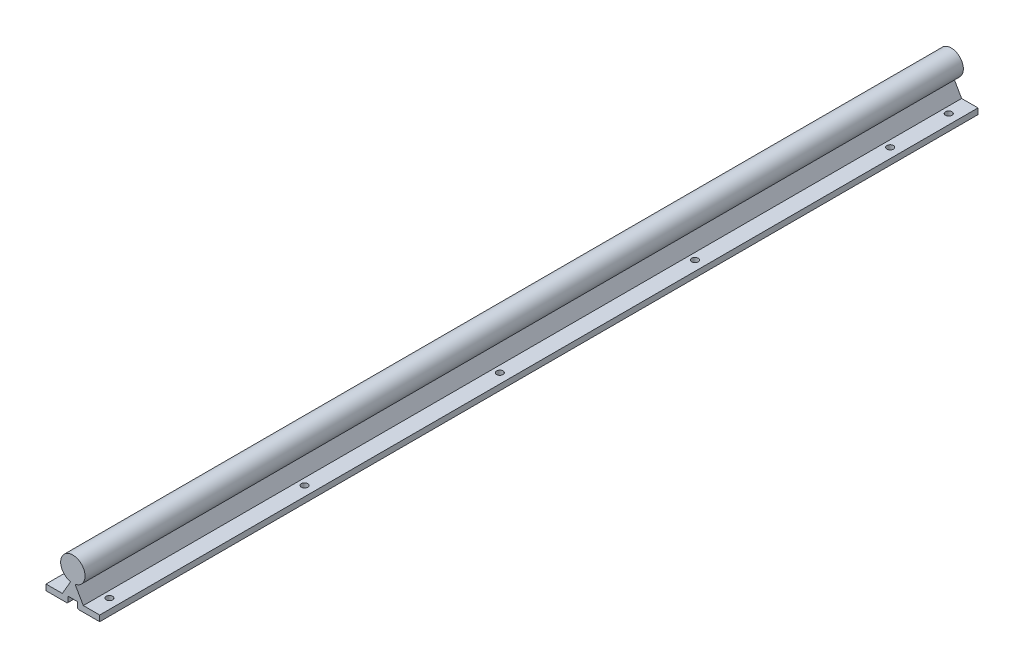
ISO-10303-21;
HEADER;
FILE_DESCRIPTION(('STEP AP214'),'2;1');
FILE_NAME('part.step','',(''),(''),'','','');
FILE_SCHEMA(('AUTOMOTIVE_DESIGN { 1 0 10303 214 1 1 1 1 }'));
ENDSEC;
DATA;
#1=APPLICATION_CONTEXT('core data for automotive mechanical design processes');
#2=APPLICATION_PROTOCOL_DEFINITION('international standard','automotive_design',2000,#1);
#3=PRODUCT_CONTEXT('',#1,'mechanical');
#4=PRODUCT('Part','Part','',(#3));
#5=PRODUCT_RELATED_PRODUCT_CATEGORY('part','',(#4));
#6=PRODUCT_DEFINITION_FORMATION('','',#4);
#7=PRODUCT_DEFINITION_CONTEXT('part definition',#1,'design');
#8=PRODUCT_DEFINITION('design','',#6,#7);
#9=PRODUCT_DEFINITION_SHAPE('','',#8);
#10=(LENGTH_UNIT() NAMED_UNIT(*) SI_UNIT(.MILLI.,.METRE.));
#11=(NAMED_UNIT(*) PLANE_ANGLE_UNIT() SI_UNIT($,.RADIAN.));
#12=(NAMED_UNIT(*) SI_UNIT($,.STERADIAN.) SOLID_ANGLE_UNIT());
#13=UNCERTAINTY_MEASURE_WITH_UNIT(LENGTH_MEASURE(1.E-05),#10,'distance_accuracy_value','');
#14=(GEOMETRIC_REPRESENTATION_CONTEXT(3) GLOBAL_UNCERTAINTY_ASSIGNED_CONTEXT((#13)) GLOBAL_UNIT_ASSIGNED_CONTEXT((#10,
#11,#12)) REPRESENTATION_CONTEXT('',''));
#15=CARTESIAN_POINT('',(0.,0.,0.));
#16=DIRECTION('',(0.,0.,1.));
#17=DIRECTION('',(1.,0.,0.));
#18=AXIS2_PLACEMENT_3D('',#15,#16,#17);
#19=CARTESIAN_POINT('',(0.,33.,-900.));
#20=DIRECTION('',(0.,0.,1.));
#21=DIRECTION('',(1.,0.,0.));
#22=AXIS2_PLACEMENT_3D('',#19,#20,#21);
#23=CYLINDRICAL_SURFACE('',#22,12.5);
#24=CARTESIAN_POINT('',(0.,33.,0.));
#25=DIRECTION('',(0.,0.,1.));
#26=DIRECTION('',(1.,0.,0.));
#27=AXIS2_PLACEMENT_3D('',#24,#25,#26);
#28=CIRCLE('',#27,12.5);
#29=CARTESIAN_POINT('',(2.25953540055394,20.7059160661055,0.));
#30=VERTEX_POINT('',#29);
#31=CARTESIAN_POINT('',(-2.25953540055394,20.7059160661055,0.));
#32=VERTEX_POINT('',#31);
#33=EDGE_CURVE('E202',#30,#32,#28,.T.);
#34=ORIENTED_EDGE('',*,*,#33,.F.);
#35=DIRECTION('',(0.,0.,1.));
#36=VECTOR('',#35,1.);
#37=CARTESIAN_POINT('',(2.25953540055394,20.7059160661055,-900.));
#38=LINE('',#37,#36);
#39=CARTESIAN_POINT('',(2.25953540055394,20.7059160661055,-900.));
#40=VERTEX_POINT('',#39);
#41=EDGE_CURVE('E170',#40,#30,#38,.T.);
#42=ORIENTED_EDGE('',*,*,#41,.F.);
#43=CARTESIAN_POINT('',(0.,33.,-900.));
#44=DIRECTION('',(0.,0.,1.));
#45=DIRECTION('',(1.,0.,0.));
#46=AXIS2_PLACEMENT_3D('',#43,#44,#45);
#47=CIRCLE('',#46,12.5);
#48=CARTESIAN_POINT('',(-2.25953540055394,20.7059160661055,-900.));
#49=VERTEX_POINT('',#48);
#50=EDGE_CURVE('E151',#40,#49,#47,.T.);
#51=ORIENTED_EDGE('',*,*,#50,.T.);
#52=DIRECTION('',(0.,0.,1.));
#53=VECTOR('',#52,1.);
#54=CARTESIAN_POINT('',(-2.25953540055394,20.7059160661055,-900.));
#55=LINE('',#54,#53);
#56=EDGE_CURVE('E160',#49,#32,#55,.T.);
#57=ORIENTED_EDGE('',*,*,#56,.T.);
#58=EDGE_LOOP('',(#34,#42,#51,#57));
#59=FACE_BOUND('',#58,.T.);
#60=ADVANCED_FACE('F43',(#59),#23,.T.);
#61=CARTESIAN_POINT('',(10.6605762113533,6.15488654534137,-900.));
#62=DIRECTION('',(0.866025403784438,0.500000000000001,0.));
#63=DIRECTION('',(-0.500000000000001,0.866025403784438,0.));
#64=AXIS2_PLACEMENT_3D('',#61,#62,#63);
#65=PLANE('',#64);
#66=DIRECTION('',(-0.500000000000001,0.866025403784438,0.));
#67=VECTOR('',#66,1.);
#68=CARTESIAN_POINT('',(10.6605762113533,6.15488654534137,0.));
#69=LINE('',#68,#67);
#70=CARTESIAN_POINT('',(10.75,6.,0.));
#71=VERTEX_POINT('',#70);
#72=EDGE_CURVE('E171',#71,#30,#69,.T.);
#73=ORIENTED_EDGE('',*,*,#72,.F.);
#74=DIRECTION('',(0.,0.,1.));
#75=VECTOR('',#74,1.);
#76=CARTESIAN_POINT('',(10.75,6.,-900.));
#77=LINE('',#76,#75);
#78=CARTESIAN_POINT('',(10.75,6.,-900.));
#79=VERTEX_POINT('',#78);
#80=EDGE_CURVE('E228',#79,#71,#77,.T.);
#81=ORIENTED_EDGE('',*,*,#80,.F.);
#82=DIRECTION('',(-0.500000000000001,0.866025403784438,0.));
#83=VECTOR('',#82,1.);
#84=CARTESIAN_POINT('',(10.6605762113533,6.15488654534137,-900.));
#85=LINE('',#84,#83);
#86=EDGE_CURVE('E168',#79,#40,#85,.T.);
#87=ORIENTED_EDGE('',*,*,#86,.T.);
#88=ORIENTED_EDGE('',*,*,#41,.T.);
#89=EDGE_LOOP('',(#73,#81,#87,#88));
#90=FACE_BOUND('',#89,.T.);
#91=ADVANCED_FACE('F308',(#90),#65,.T.);
#92=CARTESIAN_POINT('',(0.,6.,-900.));
#93=DIRECTION('',(0.,1.,0.));
#94=DIRECTION('',(0.,0.,1.));
#95=AXIS2_PLACEMENT_3D('',#92,#93,#94);
#96=PLANE('',#95);
#97=CARTESIAN_POINT('',(17.5,6.,-420.));
#98=DIRECTION('',(0.,1.,0.));
#99=DIRECTION('',(0.,0.,1.));
#100=AXIS2_PLACEMENT_3D('',#97,#98,#99);
#101=CIRCLE('',#100,3.30000000000001);
#102=CARTESIAN_POINT('',(17.5,6.,-416.7));
#103=VERTEX_POINT('',#102);
#104=EDGE_CURVE('E177',#103,#103,#101,.T.);
#105=ORIENTED_EDGE('',*,*,#104,.F.);
#106=EDGE_LOOP('',(#105));
#107=FACE_BOUND('',#106,.T.);
#108=CARTESIAN_POINT('',(17.5,6.,-220.));
#109=DIRECTION('',(0.,1.,0.));
#110=DIRECTION('',(0.,0.,1.));
#111=AXIS2_PLACEMENT_3D('',#108,#109,#110);
#112=CIRCLE('',#111,3.30000000000001);
#113=CARTESIAN_POINT('',(17.5,6.,-216.7));
#114=VERTEX_POINT('',#113);
#115=EDGE_CURVE('E294',#114,#114,#112,.T.);
#116=ORIENTED_EDGE('',*,*,#115,.F.);
#117=EDGE_LOOP('',(#116));
#118=FACE_BOUND('',#117,.T.);
#119=CARTESIAN_POINT('',(17.5,6.,-820.));
#120=DIRECTION('',(0.,1.,0.));
#121=DIRECTION('',(0.,0.,1.));
#122=AXIS2_PLACEMENT_3D('',#119,#120,#121);
#123=CIRCLE('',#122,3.30000000000002);
#124=CARTESIAN_POINT('',(17.5,6.,-816.7));
#125=VERTEX_POINT('',#124);
#126=EDGE_CURVE('E292',#125,#125,#123,.T.);
#127=ORIENTED_EDGE('',*,*,#126,.F.);
#128=EDGE_LOOP('',(#127));
#129=FACE_BOUND('',#128,.T.);
#130=CARTESIAN_POINT('',(17.5,6.,-620.));
#131=DIRECTION('',(0.,1.,0.));
#132=DIRECTION('',(0.,0.,1.));
#133=AXIS2_PLACEMENT_3D('',#130,#131,#132);
#134=CIRCLE('',#133,3.30000000000002);
#135=CARTESIAN_POINT('',(17.5,6.,-616.7));
#136=VERTEX_POINT('',#135);
#137=EDGE_CURVE('E285',#136,#136,#134,.T.);
#138=ORIENTED_EDGE('',*,*,#137,.F.);
#139=EDGE_LOOP('',(#138));
#140=FACE_BOUND('',#139,.T.);
#141=CARTESIAN_POINT('',(17.5,6.,-880.));
#142=DIRECTION('',(0.,1.,0.));
#143=DIRECTION('',(0.,0.,1.));
#144=AXIS2_PLACEMENT_3D('',#141,#142,#143);
#145=CIRCLE('',#144,3.3000000000001);
#146=CARTESIAN_POINT('',(17.5,6.,-876.7));
#147=VERTEX_POINT('',#146);
#148=EDGE_CURVE('E280',#147,#147,#145,.T.);
#149=ORIENTED_EDGE('',*,*,#148,.F.);
#150=EDGE_LOOP('',(#149));
#151=FACE_BOUND('',#150,.T.);
#152=CARTESIAN_POINT('',(17.5,6.,-20.));
#153=DIRECTION('',(0.,1.,0.));
#154=DIRECTION('',(0.,0.,1.));
#155=AXIS2_PLACEMENT_3D('',#152,#153,#154);
#156=CIRCLE('',#155,3.3);
#157=CARTESIAN_POINT('',(17.5,6.,-16.7));
#158=VERTEX_POINT('',#157);
#159=EDGE_CURVE('E276',#158,#158,#156,.T.);
#160=ORIENTED_EDGE('',*,*,#159,.F.);
#161=EDGE_LOOP('',(#160));
#162=FACE_BOUND('',#161,.T.);
#163=DIRECTION('',(-1.,0.,0.));
#164=VECTOR('',#163,1.);
#165=CARTESIAN_POINT('',(0.,6.,0.));
#166=LINE('',#165,#164);
#167=CARTESIAN_POINT('',(27.5,6.,0.));
#168=VERTEX_POINT('',#167);
#169=EDGE_CURVE('E174',#168,#71,#166,.T.);
#170=ORIENTED_EDGE('',*,*,#169,.F.);
#171=DIRECTION('',(0.,0.,1.));
#172=VECTOR('',#171,1.);
#173=CARTESIAN_POINT('',(27.5,6.,-900.));
#174=LINE('',#173,#172);
#175=CARTESIAN_POINT('',(27.5,6.,-900.));
#176=VERTEX_POINT('',#175);
#177=EDGE_CURVE('E230',#176,#168,#174,.T.);
#178=ORIENTED_EDGE('',*,*,#177,.F.);
#179=DIRECTION('',(-1.,0.,0.));
#180=VECTOR('',#179,1.);
#181=CARTESIAN_POINT('',(0.,6.,-900.));
#182=LINE('',#181,#180);
#183=EDGE_CURVE('E198',#176,#79,#182,.T.);
#184=ORIENTED_EDGE('',*,*,#183,.T.);
#185=ORIENTED_EDGE('',*,*,#80,.T.);
#186=EDGE_LOOP('',(#170,#178,#184,#185));
#187=FACE_BOUND('',#186,.T.);
#188=ADVANCED_FACE('F304',(#107,#118,#129,#140,#151,#162,#187),#96,.T.);
#189=CARTESIAN_POINT('',(27.5,0.,-900.));
#190=DIRECTION('',(1.,0.,0.));
#191=DIRECTION('',(0.,0.,-1.));
#192=AXIS2_PLACEMENT_3D('',#189,#190,#191);
#193=PLANE('',#192);
#194=DIRECTION('',(0.,1.,0.));
#195=VECTOR('',#194,1.);
#196=CARTESIAN_POINT('',(27.5,0.,0.));
#197=LINE('',#196,#195);
#198=CARTESIAN_POINT('',(27.5,0.,0.));
#199=VERTEX_POINT('',#198);
#200=EDGE_CURVE('E221',#199,#168,#197,.T.);
#201=ORIENTED_EDGE('',*,*,#200,.F.);
#202=DIRECTION('',(0.,0.,1.));
#203=VECTOR('',#202,1.);
#204=CARTESIAN_POINT('',(27.5,0.,-900.));
#205=LINE('',#204,#203);
#206=CARTESIAN_POINT('',(27.5,0.,-900.));
#207=VERTEX_POINT('',#206);
#208=EDGE_CURVE('E232',#207,#199,#205,.T.);
#209=ORIENTED_EDGE('',*,*,#208,.F.);
#210=DIRECTION('',(0.,1.,0.));
#211=VECTOR('',#210,1.);
#212=CARTESIAN_POINT('',(27.5,0.,-900.));
#213=LINE('',#212,#211);
#214=EDGE_CURVE('E195',#207,#176,#213,.T.);
#215=ORIENTED_EDGE('',*,*,#214,.T.);
#216=ORIENTED_EDGE('',*,*,#177,.T.);
#217=EDGE_LOOP('',(#201,#209,#215,#216));
#218=FACE_BOUND('',#217,.T.);
#219=ADVANCED_FACE('F307',(#218),#193,.T.);
#220=CARTESIAN_POINT('',(0.,0.,-900.));
#221=DIRECTION('',(0.,1.,0.));
#222=DIRECTION('',(0.,0.,1.));
#223=AXIS2_PLACEMENT_3D('',#220,#221,#222);
#224=PLANE('',#223);
#225=CARTESIAN_POINT('',(17.5,0.,-420.));
#226=DIRECTION('',(0.,1.,0.));
#227=DIRECTION('',(0.,0.,1.));
#228=AXIS2_PLACEMENT_3D('',#225,#226,#227);
#229=CIRCLE('',#228,3.30000000000001);
#230=CARTESIAN_POINT('',(17.5,0.,-416.7));
#231=VERTEX_POINT('',#230);
#232=EDGE_CURVE('E463',#231,#231,#229,.T.);
#233=ORIENTED_EDGE('',*,*,#232,.T.);
#234=EDGE_LOOP('',(#233));
#235=FACE_BOUND('',#234,.T.);
#236=CARTESIAN_POINT('',(17.5,0.,-220.));
#237=DIRECTION('',(0.,1.,0.));
#238=DIRECTION('',(0.,0.,1.));
#239=AXIS2_PLACEMENT_3D('',#236,#237,#238);
#240=CIRCLE('',#239,3.30000000000001);
#241=CARTESIAN_POINT('',(17.5,0.,-216.7));
#242=VERTEX_POINT('',#241);
#243=EDGE_CURVE('E469',#242,#242,#240,.T.);
#244=ORIENTED_EDGE('',*,*,#243,.T.);
#245=EDGE_LOOP('',(#244));
#246=FACE_BOUND('',#245,.T.);
#247=CARTESIAN_POINT('',(17.5,0.,-820.));
#248=DIRECTION('',(0.,1.,0.));
#249=DIRECTION('',(0.,0.,1.));
#250=AXIS2_PLACEMENT_3D('',#247,#248,#249);
#251=CIRCLE('',#250,3.30000000000002);
#252=CARTESIAN_POINT('',(17.5,0.,-816.7));
#253=VERTEX_POINT('',#252);
#254=EDGE_CURVE('E449',#253,#253,#251,.T.);
#255=ORIENTED_EDGE('',*,*,#254,.T.);
#256=EDGE_LOOP('',(#255));
#257=FACE_BOUND('',#256,.T.);
#258=CARTESIAN_POINT('',(17.5,0.,-620.));
#259=DIRECTION('',(0.,1.,0.));
#260=DIRECTION('',(0.,0.,1.));
#261=AXIS2_PLACEMENT_3D('',#258,#259,#260);
#262=CIRCLE('',#261,3.30000000000002);
#263=CARTESIAN_POINT('',(17.5,0.,-616.7));
#264=VERTEX_POINT('',#263);
#265=EDGE_CURVE('E457',#264,#264,#262,.T.);
#266=ORIENTED_EDGE('',*,*,#265,.T.);
#267=EDGE_LOOP('',(#266));
#268=FACE_BOUND('',#267,.T.);
#269=CARTESIAN_POINT('',(17.5,0.,-880.));
#270=DIRECTION('',(0.,1.,0.));
#271=DIRECTION('',(0.,0.,1.));
#272=AXIS2_PLACEMENT_3D('',#269,#270,#271);
#273=CIRCLE('',#272,3.3000000000001);
#274=CARTESIAN_POINT('',(17.5,0.,-876.7));
#275=VERTEX_POINT('',#274);
#276=EDGE_CURVE('E443',#275,#275,#273,.T.);
#277=ORIENTED_EDGE('',*,*,#276,.T.);
#278=EDGE_LOOP('',(#277));
#279=FACE_BOUND('',#278,.T.);
#280=CARTESIAN_POINT('',(17.5,0.,-20.));
#281=DIRECTION('',(0.,1.,0.));
#282=DIRECTION('',(0.,0.,1.));
#283=AXIS2_PLACEMENT_3D('',#280,#281,#282);
#284=CIRCLE('',#283,3.3);
#285=CARTESIAN_POINT('',(17.5,0.,-16.7));
#286=VERTEX_POINT('',#285);
#287=EDGE_CURVE('E263',#286,#286,#284,.T.);
#288=ORIENTED_EDGE('',*,*,#287,.T.);
#289=EDGE_LOOP('',(#288));
#290=FACE_BOUND('',#289,.T.);
#291=DIRECTION('',(-1.,0.,0.));
#292=VECTOR('',#291,1.);
#293=CARTESIAN_POINT('',(0.,0.,0.));
#294=LINE('',#293,#292);
#295=CARTESIAN_POINT('',(5.75,0.,0.));
#296=VERTEX_POINT('',#295);
#297=EDGE_CURVE('E219',#199,#296,#294,.T.);
#298=ORIENTED_EDGE('',*,*,#297,.T.);
#299=DIRECTION('',(0.,0.,-1.));
#300=VECTOR('',#299,1.);
#301=CARTESIAN_POINT('',(5.75,0.,-900.));
#302=LINE('',#301,#300);
#303=CARTESIAN_POINT('',(5.75,0.,-900.));
#304=VERTEX_POINT('',#303);
#305=EDGE_CURVE('E11',#296,#304,#302,.T.);
#306=ORIENTED_EDGE('',*,*,#305,.T.);
#307=DIRECTION('',(-1.,0.,0.));
#308=VECTOR('',#307,1.);
#309=CARTESIAN_POINT('',(0.,0.,-900.));
#310=LINE('',#309,#308);
#311=EDGE_CURVE('E193',#207,#304,#310,.T.);
#312=ORIENTED_EDGE('',*,*,#311,.F.);
#313=ORIENTED_EDGE('',*,*,#208,.T.);
#314=EDGE_LOOP('',(#298,#306,#312,#313));
#315=FACE_BOUND('',#314,.T.);
#316=ADVANCED_FACE('F390',(#235,#246,#257,#268,#279,#290,#315),#224,.F.);
#317=CARTESIAN_POINT('',(4.75,0.,-900.));
#318=DIRECTION('',(1.,0.,0.));
#319=DIRECTION('',(0.,0.,-1.));
#320=AXIS2_PLACEMENT_3D('',#317,#318,#319);
#321=PLANE('',#320);
#322=DIRECTION('',(0.,1.,0.));
#323=VECTOR('',#322,1.);
#324=CARTESIAN_POINT('',(4.75,0.,-900.));
#325=LINE('',#324,#323);
#326=CARTESIAN_POINT('',(4.75,1.,-900.));
#327=VERTEX_POINT('',#326);
#328=CARTESIAN_POINT('',(4.75,6.5,-900.));
#329=VERTEX_POINT('',#328);
#330=EDGE_CURVE('E191',#327,#329,#325,.T.);
#331=ORIENTED_EDGE('',*,*,#330,.F.);
#332=DIRECTION('',(0.,0.,1.));
#333=VECTOR('',#332,1.);
#334=CARTESIAN_POINT('',(4.75,1.,-900.));
#335=LINE('',#334,#333);
#336=CARTESIAN_POINT('',(4.75,1.,0.));
#337=VERTEX_POINT('',#336);
#338=EDGE_CURVE('E52',#327,#337,#335,.T.);
#339=ORIENTED_EDGE('',*,*,#338,.T.);
#340=DIRECTION('',(0.,1.,0.));
#341=VECTOR('',#340,1.);
#342=CARTESIAN_POINT('',(4.75,0.,0.));
#343=LINE('',#342,#341);
#344=CARTESIAN_POINT('',(4.75,6.5,0.));
#345=VERTEX_POINT('',#344);
#346=EDGE_CURVE('E217',#337,#345,#343,.T.);
#347=ORIENTED_EDGE('',*,*,#346,.T.);
#348=DIRECTION('',(0.,0.,1.));
#349=VECTOR('',#348,1.);
#350=CARTESIAN_POINT('',(4.75,6.5,-900.));
#351=LINE('',#350,#349);
#352=EDGE_CURVE('E234',#329,#345,#351,.T.);
#353=ORIENTED_EDGE('',*,*,#352,.F.);
#354=EDGE_LOOP('',(#331,#339,#347,#353));
#355=FACE_BOUND('',#354,.T.);
#356=ADVANCED_FACE('F356',(#355),#321,.F.);
#357=CARTESIAN_POINT('',(0.,6.5,-900.));
#358=DIRECTION('',(0.,-1.,0.));
#359=DIRECTION('',(0.,0.,-1.));
#360=AXIS2_PLACEMENT_3D('',#357,#358,#359);
#361=PLANE('',#360);
#362=DIRECTION('',(1.,0.,0.));
#363=VECTOR('',#362,1.);
#364=CARTESIAN_POINT('',(0.,6.5,0.));
#365=LINE('',#364,#363);
#366=CARTESIAN_POINT('',(-4.75,6.5,0.));
#367=VERTEX_POINT('',#366);
#368=EDGE_CURVE('E214',#367,#345,#365,.T.);
#369=ORIENTED_EDGE('',*,*,#368,.F.);
#370=DIRECTION('',(0.,0.,1.));
#371=VECTOR('',#370,1.);
#372=CARTESIAN_POINT('',(-4.75,6.5,-900.));
#373=LINE('',#372,#371);
#374=CARTESIAN_POINT('',(-4.75,6.5,-900.));
#375=VERTEX_POINT('',#374);
#376=EDGE_CURVE('E237',#375,#367,#373,.T.);
#377=ORIENTED_EDGE('',*,*,#376,.F.);
#378=DIRECTION('',(1.,0.,0.));
#379=VECTOR('',#378,1.);
#380=CARTESIAN_POINT('',(0.,6.5,-900.));
#381=LINE('',#380,#379);
#382=EDGE_CURVE('E188',#375,#329,#381,.T.);
#383=ORIENTED_EDGE('',*,*,#382,.T.);
#384=ORIENTED_EDGE('',*,*,#352,.T.);
#385=EDGE_LOOP('',(#369,#377,#383,#384));
#386=FACE_BOUND('',#385,.T.);
#387=ADVANCED_FACE('F352',(#386),#361,.T.);
#388=CARTESIAN_POINT('',(-4.75,0.,-900.));
#389=DIRECTION('',(1.,0.,0.));
#390=DIRECTION('',(0.,0.,-1.));
#391=AXIS2_PLACEMENT_3D('',#388,#389,#390);
#392=PLANE('',#391);
#393=DIRECTION('',(0.,1.,0.));
#394=VECTOR('',#393,1.);
#395=CARTESIAN_POINT('',(-4.75,0.,0.));
#396=LINE('',#395,#394);
#397=CARTESIAN_POINT('',(-4.75,1.,0.));
#398=VERTEX_POINT('',#397);
#399=EDGE_CURVE('E212',#398,#367,#396,.T.);
#400=ORIENTED_EDGE('',*,*,#399,.F.);
#401=DIRECTION('',(0.,0.,-1.));
#402=VECTOR('',#401,1.);
#403=CARTESIAN_POINT('',(-4.75,1.,-900.));
#404=LINE('',#403,#402);
#405=CARTESIAN_POINT('',(-4.75,1.,-900.));
#406=VERTEX_POINT('',#405);
#407=EDGE_CURVE('E252',#398,#406,#404,.T.);
#408=ORIENTED_EDGE('',*,*,#407,.T.);
#409=DIRECTION('',(0.,1.,0.));
#410=VECTOR('',#409,1.);
#411=CARTESIAN_POINT('',(-4.75,0.,-900.));
#412=LINE('',#411,#410);
#413=EDGE_CURVE('E186',#406,#375,#412,.T.);
#414=ORIENTED_EDGE('',*,*,#413,.T.);
#415=ORIENTED_EDGE('',*,*,#376,.T.);
#416=EDGE_LOOP('',(#400,#408,#414,#415));
#417=FACE_BOUND('',#416,.T.);
#418=ADVANCED_FACE('F345',(#417),#392,.T.);
#419=CARTESIAN_POINT('',(0.,0.,-900.));
#420=DIRECTION('',(0.,-1.,0.));
#421=DIRECTION('',(0.,0.,-1.));
#422=AXIS2_PLACEMENT_3D('',#419,#420,#421);
#423=PLANE('',#422);
#424=CARTESIAN_POINT('',(-17.5,0.,-820.));
#425=DIRECTION('',(0.,1.,0.));
#426=DIRECTION('',(0.,0.,-1.));
#427=AXIS2_PLACEMENT_3D('',#424,#425,#426);
#428=CIRCLE('',#427,3.30000000000002);
#429=CARTESIAN_POINT('',(-17.5,0.,-823.3));
#430=VERTEX_POINT('',#429);
#431=EDGE_CURVE('E445',#430,#430,#428,.T.);
#432=ORIENTED_EDGE('',*,*,#431,.T.);
#433=EDGE_LOOP('',(#432));
#434=FACE_BOUND('',#433,.T.);
#435=CARTESIAN_POINT('',(-17.5,0.,-220.));
#436=DIRECTION('',(0.,1.,0.));
#437=DIRECTION('',(0.,0.,-1.));
#438=AXIS2_PLACEMENT_3D('',#435,#436,#437);
#439=CIRCLE('',#438,3.30000000000001);
#440=CARTESIAN_POINT('',(-17.5,0.,-223.3));
#441=VERTEX_POINT('',#440);
#442=EDGE_CURVE('E466',#441,#441,#439,.T.);
#443=ORIENTED_EDGE('',*,*,#442,.T.);
#444=EDGE_LOOP('',(#443));
#445=FACE_BOUND('',#444,.T.);
#446=CARTESIAN_POINT('',(-17.5,0.,-20.));
#447=DIRECTION('',(0.,1.,0.));
#448=DIRECTION('',(0.,0.,-1.));
#449=AXIS2_PLACEMENT_3D('',#446,#447,#448);
#450=CIRCLE('',#449,3.3);
#451=CARTESIAN_POINT('',(-17.5,0.,-23.3));
#452=VERTEX_POINT('',#451);
#453=EDGE_CURVE('E472',#452,#452,#450,.T.);
#454=ORIENTED_EDGE('',*,*,#453,.T.);
#455=EDGE_LOOP('',(#454));
#456=FACE_BOUND('',#455,.T.);
#457=CARTESIAN_POINT('',(-17.5,0.,-620.));
#458=DIRECTION('',(0.,1.,0.));
#459=DIRECTION('',(0.,0.,-1.));
#460=AXIS2_PLACEMENT_3D('',#457,#458,#459);
#461=CIRCLE('',#460,3.30000000000002);
#462=CARTESIAN_POINT('',(-17.5,0.,-623.3));
#463=VERTEX_POINT('',#462);
#464=EDGE_CURVE('E454',#463,#463,#461,.T.);
#465=ORIENTED_EDGE('',*,*,#464,.T.);
#466=EDGE_LOOP('',(#465));
#467=FACE_BOUND('',#466,.T.);
#468=CARTESIAN_POINT('',(-17.5,0.,-420.));
#469=DIRECTION('',(0.,1.,0.));
#470=DIRECTION('',(0.,0.,-1.));
#471=AXIS2_PLACEMENT_3D('',#468,#469,#470);
#472=CIRCLE('',#471,3.30000000000001);
#473=CARTESIAN_POINT('',(-17.5,0.,-423.3));
#474=VERTEX_POINT('',#473);
#475=EDGE_CURVE('E460',#474,#474,#472,.T.);
#476=ORIENTED_EDGE('',*,*,#475,.T.);
#477=EDGE_LOOP('',(#476));
#478=FACE_BOUND('',#477,.T.);
#479=CARTESIAN_POINT('',(-17.5,0.,-880.));
#480=DIRECTION('',(0.,1.,0.));
#481=DIRECTION('',(0.,0.,-1.));
#482=AXIS2_PLACEMENT_3D('',#479,#480,#481);
#483=CIRCLE('',#482,3.3000000000001);
#484=CARTESIAN_POINT('',(-17.5,0.,-883.3));
#485=VERTEX_POINT('',#484);
#486=EDGE_CURVE('E446',#485,#485,#483,.T.);
#487=ORIENTED_EDGE('',*,*,#486,.T.);
#488=EDGE_LOOP('',(#487));
#489=FACE_BOUND('',#488,.T.);
#490=DIRECTION('',(1.,0.,0.));
#491=VECTOR('',#490,1.);
#492=CARTESIAN_POINT('',(0.,0.,-900.));
#493=LINE('',#492,#491);
#494=CARTESIAN_POINT('',(-27.5,0.,-900.));
#495=VERTEX_POINT('',#494);
#496=CARTESIAN_POINT('',(-5.75,0.,-900.));
#497=VERTEX_POINT('',#496);
#498=EDGE_CURVE('E183',#495,#497,#493,.T.);
#499=ORIENTED_EDGE('',*,*,#498,.T.);
#500=DIRECTION('',(0.,0.,1.));
#501=VECTOR('',#500,1.);
#502=CARTESIAN_POINT('',(-5.75,0.,-900.));
#503=LINE('',#502,#501);
#504=CARTESIAN_POINT('',(-5.75,0.,0.));
#505=VERTEX_POINT('',#504);
#506=EDGE_CURVE('E227',#497,#505,#503,.T.);
#507=ORIENTED_EDGE('',*,*,#506,.T.);
#508=DIRECTION('',(1.,0.,0.));
#509=VECTOR('',#508,1.);
#510=CARTESIAN_POINT('',(0.,0.,0.));
#511=LINE('',#510,#509);
#512=CARTESIAN_POINT('',(-27.5,0.,0.));
#513=VERTEX_POINT('',#512);
#514=EDGE_CURVE('E209',#513,#505,#511,.T.);
#515=ORIENTED_EDGE('',*,*,#514,.F.);
#516=DIRECTION('',(0.,0.,1.));
#517=VECTOR('',#516,1.);
#518=CARTESIAN_POINT('',(-27.5,0.,-900.));
#519=LINE('',#518,#517);
#520=EDGE_CURVE('E240',#495,#513,#519,.T.);
#521=ORIENTED_EDGE('',*,*,#520,.F.);
#522=EDGE_LOOP('',(#499,#507,#515,#521));
#523=FACE_BOUND('',#522,.T.);
#524=ADVANCED_FACE('F339',(#434,#445,#456,#467,#478,#489,#523),#423,.T.);
#525=CARTESIAN_POINT('',(-27.5,0.,-900.));
#526=DIRECTION('',(1.,0.,0.));
#527=DIRECTION('',(0.,0.,-1.));
#528=AXIS2_PLACEMENT_3D('',#525,#526,#527);
#529=PLANE('',#528);
#530=DIRECTION('',(0.,1.,0.));
#531=VECTOR('',#530,1.);
#532=CARTESIAN_POINT('',(-27.5,0.,0.));
#533=LINE('',#532,#531);
#534=CARTESIAN_POINT('',(-27.5,6.,0.));
#535=VERTEX_POINT('',#534);
#536=EDGE_CURVE('E207',#513,#535,#533,.T.);
#537=ORIENTED_EDGE('',*,*,#536,.T.);
#538=DIRECTION('',(0.,0.,1.));
#539=VECTOR('',#538,1.);
#540=CARTESIAN_POINT('',(-27.5,6.,-900.));
#541=LINE('',#540,#539);
#542=CARTESIAN_POINT('',(-27.5,6.,-900.));
#543=VERTEX_POINT('',#542);
#544=EDGE_CURVE('E242',#543,#535,#541,.T.);
#545=ORIENTED_EDGE('',*,*,#544,.F.);
#546=DIRECTION('',(0.,1.,0.));
#547=VECTOR('',#546,1.);
#548=CARTESIAN_POINT('',(-27.5,0.,-900.));
#549=LINE('',#548,#547);
#550=EDGE_CURVE('E181',#495,#543,#549,.T.);
#551=ORIENTED_EDGE('',*,*,#550,.F.);
#552=ORIENTED_EDGE('',*,*,#520,.T.);
#553=EDGE_LOOP('',(#537,#545,#551,#552));
#554=FACE_BOUND('',#553,.T.);
#555=ADVANCED_FACE('F336',(#554),#529,.F.);
#556=CARTESIAN_POINT('',(0.,6.,-900.));
#557=DIRECTION('',(0.,-1.,0.));
#558=DIRECTION('',(0.,0.,-1.));
#559=AXIS2_PLACEMENT_3D('',#556,#557,#558);
#560=PLANE('',#559);
#561=CARTESIAN_POINT('',(-17.5,6.,-820.));
#562=DIRECTION('',(0.,-1.,0.));
#563=DIRECTION('',(0.,0.,-1.));
#564=AXIS2_PLACEMENT_3D('',#561,#562,#563);
#565=CIRCLE('',#564,3.30000000000002);
#566=CARTESIAN_POINT('',(-17.5,6.,-823.3));
#567=VERTEX_POINT('',#566);
#568=EDGE_CURVE('E47',#567,#567,#565,.T.);
#569=ORIENTED_EDGE('',*,*,#568,.T.);
#570=EDGE_LOOP('',(#569));
#571=FACE_BOUND('',#570,.T.);
#572=CARTESIAN_POINT('',(-17.5,6.,-220.));
#573=DIRECTION('',(0.,-1.,0.));
#574=DIRECTION('',(0.,0.,-1.));
#575=AXIS2_PLACEMENT_3D('',#572,#573,#574);
#576=CIRCLE('',#575,3.30000000000001);
#577=CARTESIAN_POINT('',(-17.5,6.,-223.3));
#578=VERTEX_POINT('',#577);
#579=EDGE_CURVE('E271',#578,#578,#576,.T.);
#580=ORIENTED_EDGE('',*,*,#579,.T.);
#581=EDGE_LOOP('',(#580));
#582=FACE_BOUND('',#581,.T.);
#583=CARTESIAN_POINT('',(-17.5,6.,-20.));
#584=DIRECTION('',(0.,-1.,0.));
#585=DIRECTION('',(0.,0.,-1.));
#586=AXIS2_PLACEMENT_3D('',#583,#584,#585);
#587=CIRCLE('',#586,3.3);
#588=CARTESIAN_POINT('',(-17.5,6.,-23.3));
#589=VERTEX_POINT('',#588);
#590=EDGE_CURVE('E269',#589,#589,#587,.T.);
#591=ORIENTED_EDGE('',*,*,#590,.T.);
#592=EDGE_LOOP('',(#591));
#593=FACE_BOUND('',#592,.T.);
#594=CARTESIAN_POINT('',(-17.5,6.,-620.));
#595=DIRECTION('',(0.,-1.,0.));
#596=DIRECTION('',(0.,0.,-1.));
#597=AXIS2_PLACEMENT_3D('',#594,#595,#596);
#598=CIRCLE('',#597,3.30000000000002);
#599=CARTESIAN_POINT('',(-17.5,6.,-623.3));
#600=VERTEX_POINT('',#599);
#601=EDGE_CURVE('E266',#600,#600,#598,.T.);
#602=ORIENTED_EDGE('',*,*,#601,.T.);
#603=EDGE_LOOP('',(#602));
#604=FACE_BOUND('',#603,.T.);
#605=CARTESIAN_POINT('',(-17.5,6.,-420.));
#606=DIRECTION('',(0.,-1.,0.));
#607=DIRECTION('',(0.,0.,-1.));
#608=AXIS2_PLACEMENT_3D('',#605,#606,#607);
#609=CIRCLE('',#608,3.30000000000001);
#610=CARTESIAN_POINT('',(-17.5,6.,-423.3));
#611=VERTEX_POINT('',#610);
#612=EDGE_CURVE('E262',#611,#611,#609,.T.);
#613=ORIENTED_EDGE('',*,*,#612,.T.);
#614=EDGE_LOOP('',(#613));
#615=FACE_BOUND('',#614,.T.);
#616=CARTESIAN_POINT('',(-17.5,6.,-880.));
#617=DIRECTION('',(0.,-1.,0.));
#618=DIRECTION('',(0.,0.,-1.));
#619=AXIS2_PLACEMENT_3D('',#616,#617,#618);
#620=CIRCLE('',#619,3.3000000000001);
#621=CARTESIAN_POINT('',(-17.5,6.,-883.3));
#622=VERTEX_POINT('',#621);
#623=EDGE_CURVE('E259',#622,#622,#620,.T.);
#624=ORIENTED_EDGE('',*,*,#623,.T.);
#625=EDGE_LOOP('',(#624));
#626=FACE_BOUND('',#625,.T.);
#627=DIRECTION('',(1.,0.,0.));
#628=VECTOR('',#627,1.);
#629=CARTESIAN_POINT('',(0.,6.,0.));
#630=LINE('',#629,#628);
#631=CARTESIAN_POINT('',(-10.75,6.,0.));
#632=VERTEX_POINT('',#631);
#633=EDGE_CURVE('E205',#535,#632,#630,.T.);
#634=ORIENTED_EDGE('',*,*,#633,.T.);
#635=DIRECTION('',(0.,0.,1.));
#636=VECTOR('',#635,1.);
#637=CARTESIAN_POINT('',(-10.75,6.,-900.));
#638=LINE('',#637,#636);
#639=CARTESIAN_POINT('',(-10.75,6.,-900.));
#640=VERTEX_POINT('',#639);
#641=EDGE_CURVE('E167',#640,#632,#638,.T.);
#642=ORIENTED_EDGE('',*,*,#641,.F.);
#643=DIRECTION('',(1.,0.,0.));
#644=VECTOR('',#643,1.);
#645=CARTESIAN_POINT('',(0.,6.,-900.));
#646=LINE('',#645,#644);
#647=EDGE_CURVE('E154',#543,#640,#646,.T.);
#648=ORIENTED_EDGE('',*,*,#647,.F.);
#649=ORIENTED_EDGE('',*,*,#544,.T.);
#650=EDGE_LOOP('',(#634,#642,#648,#649));
#651=FACE_BOUND('',#650,.T.);
#652=ADVANCED_FACE('F332',(#571,#582,#593,#604,#615,#626,#651),#560,.F.);
#653=CARTESIAN_POINT('',(-10.6605762113533,6.15488654534137,-900.));
#654=DIRECTION('',(0.866025403784438,-0.500000000000001,0.));
#655=DIRECTION('',(0.500000000000001,0.866025403784438,0.));
#656=AXIS2_PLACEMENT_3D('',#653,#654,#655);
#657=PLANE('',#656);
#658=DIRECTION('',(0.500000000000001,0.866025403784438,0.));
#659=VECTOR('',#658,1.);
#660=CARTESIAN_POINT('',(-10.6605762113533,6.15488654534137,0.));
#661=LINE('',#660,#659);
#662=EDGE_CURVE('E163',#632,#32,#661,.T.);
#663=ORIENTED_EDGE('',*,*,#662,.T.);
#664=ORIENTED_EDGE('',*,*,#56,.F.);
#665=DIRECTION('',(0.500000000000001,0.866025403784438,0.));
#666=VECTOR('',#665,1.);
#667=CARTESIAN_POINT('',(-10.6605762113533,6.15488654534137,-900.));
#668=LINE('',#667,#666);
#669=EDGE_CURVE('E145',#640,#49,#668,.T.);
#670=ORIENTED_EDGE('',*,*,#669,.F.);
#671=ORIENTED_EDGE('',*,*,#641,.T.);
#672=EDGE_LOOP('',(#663,#664,#670,#671));
#673=FACE_BOUND('',#672,.T.);
#674=ADVANCED_FACE('F161',(#673),#657,.F.);
#675=CARTESIAN_POINT('',(0.,0.,-900.));
#676=DIRECTION('',(0.,0.,1.));
#677=DIRECTION('',(1.,0.,0.));
#678=AXIS2_PLACEMENT_3D('',#675,#676,#677);
#679=PLANE('',#678);
#680=ORIENTED_EDGE('',*,*,#413,.F.);
#681=DIRECTION('',(0.707106781186548,0.707106781186548,0.));
#682=VECTOR('',#681,1.);
#683=CARTESIAN_POINT('',(-5.75,0.,-900.));
#684=LINE('',#683,#682);
#685=EDGE_CURVE('E255',#406,#497,#684,.F.);
#686=ORIENTED_EDGE('',*,*,#685,.T.);
#687=ORIENTED_EDGE('',*,*,#498,.F.);
#688=ORIENTED_EDGE('',*,*,#550,.T.);
#689=ORIENTED_EDGE('',*,*,#647,.T.);
#690=ORIENTED_EDGE('',*,*,#669,.T.);
#691=ORIENTED_EDGE('',*,*,#50,.F.);
#692=ORIENTED_EDGE('',*,*,#86,.F.);
#693=ORIENTED_EDGE('',*,*,#183,.F.);
#694=ORIENTED_EDGE('',*,*,#214,.F.);
#695=ORIENTED_EDGE('',*,*,#311,.T.);
#696=DIRECTION('',(0.707106781186548,-0.707106781186548,0.));
#697=VECTOR('',#696,1.);
#698=CARTESIAN_POINT('',(4.75,1.,-900.));
#699=LINE('',#698,#697);
#700=EDGE_CURVE('E60',#304,#327,#699,.F.);
#701=ORIENTED_EDGE('',*,*,#700,.T.);
#702=ORIENTED_EDGE('',*,*,#330,.T.);
#703=ORIENTED_EDGE('',*,*,#382,.F.);
#704=EDGE_LOOP('',(#680,#686,#687,#688,#689,#690,#691,#692,#693,#694,#695,#701,#702,#703));
#705=FACE_BOUND('',#704,.T.);
#706=ADVANCED_FACE('F148',(#705),#679,.F.);
#707=CARTESIAN_POINT('',(0.,0.,0.));
#708=DIRECTION('',(0.,0.,1.));
#709=DIRECTION('',(1.,0.,0.));
#710=AXIS2_PLACEMENT_3D('',#707,#708,#709);
#711=PLANE('',#710);
#712=ORIENTED_EDGE('',*,*,#514,.T.);
#713=DIRECTION('',(-0.707106781186548,-0.707106781186548,0.));
#714=VECTOR('',#713,1.);
#715=CARTESIAN_POINT('',(-2.875,2.875,0.));
#716=LINE('',#715,#714);
#717=EDGE_CURVE('E250',#505,#398,#716,.F.);
#718=ORIENTED_EDGE('',*,*,#717,.T.);
#719=ORIENTED_EDGE('',*,*,#399,.T.);
#720=ORIENTED_EDGE('',*,*,#368,.T.);
#721=ORIENTED_EDGE('',*,*,#346,.F.);
#722=DIRECTION('',(-0.707106781186548,0.707106781186548,0.));
#723=VECTOR('',#722,1.);
#724=CARTESIAN_POINT('',(2.875,2.875,0.));
#725=LINE('',#724,#723);
#726=EDGE_CURVE('E248',#337,#296,#725,.F.);
#727=ORIENTED_EDGE('',*,*,#726,.T.);
#728=ORIENTED_EDGE('',*,*,#297,.F.);
#729=ORIENTED_EDGE('',*,*,#200,.T.);
#730=ORIENTED_EDGE('',*,*,#169,.T.);
#731=ORIENTED_EDGE('',*,*,#72,.T.);
#732=ORIENTED_EDGE('',*,*,#33,.T.);
#733=ORIENTED_EDGE('',*,*,#662,.F.);
#734=ORIENTED_EDGE('',*,*,#633,.F.);
#735=ORIENTED_EDGE('',*,*,#536,.F.);
#736=EDGE_LOOP('',(#712,#718,#719,#720,#721,#727,#728,#729,#730,#731,#732,#733,#734,#735));
#737=FACE_BOUND('',#736,.T.);
#738=ADVANCED_FACE('F324',(#737),#711,.T.);
#739=CARTESIAN_POINT('',(-5.75,0.,-900.));
#740=DIRECTION('',(-0.707106781186547,0.707106781186547,0.));
#741=DIRECTION('',(0.,0.,1.));
#742=AXIS2_PLACEMENT_3D('',#739,#740,#741);
#743=PLANE('',#742);
#744=ORIENTED_EDGE('',*,*,#685,.F.);
#745=ORIENTED_EDGE('',*,*,#407,.F.);
#746=ORIENTED_EDGE('',*,*,#717,.F.);
#747=ORIENTED_EDGE('',*,*,#506,.F.);
#748=EDGE_LOOP('',(#744,#745,#746,#747));
#749=FACE_BOUND('',#748,.T.);
#750=ADVANCED_FACE('F349',(#749),#743,.F.);
#751=CARTESIAN_POINT('',(4.75,1.,-900.));
#752=DIRECTION('',(0.707106781186547,0.707106781186547,0.));
#753=DIRECTION('',(0.,0.,1.));
#754=AXIS2_PLACEMENT_3D('',#751,#752,#753);
#755=PLANE('',#754);
#756=ORIENTED_EDGE('',*,*,#700,.F.);
#757=ORIENTED_EDGE('',*,*,#305,.F.);
#758=ORIENTED_EDGE('',*,*,#726,.F.);
#759=ORIENTED_EDGE('',*,*,#338,.F.);
#760=EDGE_LOOP('',(#756,#757,#758,#759));
#761=FACE_BOUND('',#760,.T.);
#762=ADVANCED_FACE('F45',(#761),#755,.F.);
#763=CARTESIAN_POINT('',(-17.5,0.,-880.));
#764=DIRECTION('',(0.,1.,0.));
#765=DIRECTION('',(0.,0.,1.));
#766=AXIS2_PLACEMENT_3D('',#763,#764,#765);
#767=CYLINDRICAL_SURFACE('',#766,3.3000000000001);
#768=ORIENTED_EDGE('',*,*,#486,.F.);
#769=EDGE_LOOP('',(#768));
#770=FACE_BOUND('',#769,.T.);
#771=ORIENTED_EDGE('',*,*,#623,.F.);
#772=EDGE_LOOP('',(#771));
#773=FACE_BOUND('',#772,.T.);
#774=ADVANCED_FACE('F360',(#770,#773),#767,.F.);
#775=CARTESIAN_POINT('',(-17.5,0.,-420.));
#776=DIRECTION('',(0.,1.,0.));
#777=DIRECTION('',(0.,0.,1.));
#778=AXIS2_PLACEMENT_3D('',#775,#776,#777);
#779=CYLINDRICAL_SURFACE('',#778,3.30000000000001);
#780=ORIENTED_EDGE('',*,*,#475,.F.);
#781=EDGE_LOOP('',(#780));
#782=FACE_BOUND('',#781,.T.);
#783=ORIENTED_EDGE('',*,*,#612,.F.);
#784=EDGE_LOOP('',(#783));
#785=FACE_BOUND('',#784,.T.);
#786=ADVANCED_FACE('F365',(#782,#785),#779,.F.);
#787=CARTESIAN_POINT('',(-17.5,0.,-620.));
#788=DIRECTION('',(0.,1.,0.));
#789=DIRECTION('',(0.,0.,1.));
#790=AXIS2_PLACEMENT_3D('',#787,#788,#789);
#791=CYLINDRICAL_SURFACE('',#790,3.30000000000002);
#792=ORIENTED_EDGE('',*,*,#464,.F.);
#793=EDGE_LOOP('',(#792));
#794=FACE_BOUND('',#793,.T.);
#795=ORIENTED_EDGE('',*,*,#601,.F.);
#796=EDGE_LOOP('',(#795));
#797=FACE_BOUND('',#796,.T.);
#798=ADVANCED_FACE('F413',(#794,#797),#791,.F.);
#799=CARTESIAN_POINT('',(-17.5,0.,-20.));
#800=DIRECTION('',(0.,1.,0.));
#801=DIRECTION('',(0.,0.,1.));
#802=AXIS2_PLACEMENT_3D('',#799,#800,#801);
#803=CYLINDRICAL_SURFACE('',#802,3.3);
#804=ORIENTED_EDGE('',*,*,#453,.F.);
#805=EDGE_LOOP('',(#804));
#806=FACE_BOUND('',#805,.T.);
#807=ORIENTED_EDGE('',*,*,#590,.F.);
#808=EDGE_LOOP('',(#807));
#809=FACE_BOUND('',#808,.T.);
#810=ADVANCED_FACE('F409',(#806,#809),#803,.F.);
#811=CARTESIAN_POINT('',(-17.5,0.,-220.));
#812=DIRECTION('',(0.,1.,0.));
#813=DIRECTION('',(0.,0.,1.));
#814=AXIS2_PLACEMENT_3D('',#811,#812,#813);
#815=CYLINDRICAL_SURFACE('',#814,3.30000000000001);
#816=ORIENTED_EDGE('',*,*,#442,.F.);
#817=EDGE_LOOP('',(#816));
#818=FACE_BOUND('',#817,.T.);
#819=ORIENTED_EDGE('',*,*,#579,.F.);
#820=EDGE_LOOP('',(#819));
#821=FACE_BOUND('',#820,.T.);
#822=ADVANCED_FACE('F412',(#818,#821),#815,.F.);
#823=CARTESIAN_POINT('',(-17.5,0.,-820.));
#824=DIRECTION('',(0.,1.,0.));
#825=DIRECTION('',(0.,0.,1.));
#826=AXIS2_PLACEMENT_3D('',#823,#824,#825);
#827=CYLINDRICAL_SURFACE('',#826,3.30000000000002);
#828=ORIENTED_EDGE('',*,*,#431,.F.);
#829=EDGE_LOOP('',(#828));
#830=FACE_BOUND('',#829,.T.);
#831=ORIENTED_EDGE('',*,*,#568,.F.);
#832=EDGE_LOOP('',(#831));
#833=FACE_BOUND('',#832,.T.);
#834=ADVANCED_FACE('F404',(#830,#833),#827,.F.);
#835=CARTESIAN_POINT('',(17.5,0.,-20.));
#836=DIRECTION('',(0.,1.,0.));
#837=DIRECTION('',(0.,0.,1.));
#838=AXIS2_PLACEMENT_3D('',#835,#836,#837);
#839=CYLINDRICAL_SURFACE('',#838,3.3);
#840=ORIENTED_EDGE('',*,*,#159,.T.);
#841=EDGE_LOOP('',(#840));
#842=FACE_BOUND('',#841,.T.);
#843=ORIENTED_EDGE('',*,*,#287,.F.);
#844=EDGE_LOOP('',(#843));
#845=FACE_BOUND('',#844,.T.);
#846=ADVANCED_FACE('F400',(#842,#845),#839,.F.);
#847=CARTESIAN_POINT('',(17.5,0.,-880.));
#848=DIRECTION('',(0.,1.,0.));
#849=DIRECTION('',(0.,0.,1.));
#850=AXIS2_PLACEMENT_3D('',#847,#848,#849);
#851=CYLINDRICAL_SURFACE('',#850,3.3000000000001);
#852=ORIENTED_EDGE('',*,*,#148,.T.);
#853=EDGE_LOOP('',(#852));
#854=FACE_BOUND('',#853,.T.);
#855=ORIENTED_EDGE('',*,*,#276,.F.);
#856=EDGE_LOOP('',(#855));
#857=FACE_BOUND('',#856,.T.);
#858=ADVANCED_FACE('F403',(#854,#857),#851,.F.);
#859=CARTESIAN_POINT('',(17.5,0.,-620.));
#860=DIRECTION('',(0.,1.,0.));
#861=DIRECTION('',(0.,0.,1.));
#862=AXIS2_PLACEMENT_3D('',#859,#860,#861);
#863=CYLINDRICAL_SURFACE('',#862,3.30000000000002);
#864=ORIENTED_EDGE('',*,*,#137,.T.);
#865=EDGE_LOOP('',(#864));
#866=FACE_BOUND('',#865,.T.);
#867=ORIENTED_EDGE('',*,*,#265,.F.);
#868=EDGE_LOOP('',(#867));
#869=FACE_BOUND('',#868,.T.);
#870=ADVANCED_FACE('F420',(#866,#869),#863,.F.);
#871=CARTESIAN_POINT('',(17.5,0.,-820.));
#872=DIRECTION('',(0.,1.,0.));
#873=DIRECTION('',(0.,0.,1.));
#874=AXIS2_PLACEMENT_3D('',#871,#872,#873);
#875=CYLINDRICAL_SURFACE('',#874,3.30000000000002);
#876=ORIENTED_EDGE('',*,*,#126,.T.);
#877=EDGE_LOOP('',(#876));
#878=FACE_BOUND('',#877,.T.);
#879=ORIENTED_EDGE('',*,*,#254,.F.);
#880=EDGE_LOOP('',(#879));
#881=FACE_BOUND('',#880,.T.);
#882=ADVANCED_FACE('F408',(#878,#881),#875,.F.);
#883=CARTESIAN_POINT('',(17.5,0.,-220.));
#884=DIRECTION('',(0.,1.,0.));
#885=DIRECTION('',(0.,0.,1.));
#886=AXIS2_PLACEMENT_3D('',#883,#884,#885);
#887=CYLINDRICAL_SURFACE('',#886,3.30000000000001);
#888=ORIENTED_EDGE('',*,*,#115,.T.);
#889=EDGE_LOOP('',(#888));
#890=FACE_BOUND('',#889,.T.);
#891=ORIENTED_EDGE('',*,*,#243,.F.);
#892=EDGE_LOOP('',(#891));
#893=FACE_BOUND('',#892,.T.);
#894=ADVANCED_FACE('F405',(#890,#893),#887,.F.);
#895=CARTESIAN_POINT('',(17.5,0.,-420.));
#896=DIRECTION('',(0.,1.,0.));
#897=DIRECTION('',(0.,0.,1.));
#898=AXIS2_PLACEMENT_3D('',#895,#896,#897);
#899=CYLINDRICAL_SURFACE('',#898,3.30000000000001);
#900=ORIENTED_EDGE('',*,*,#104,.T.);
#901=EDGE_LOOP('',(#900));
#902=FACE_BOUND('',#901,.T.);
#903=ORIENTED_EDGE('',*,*,#232,.F.);
#904=EDGE_LOOP('',(#903));
#905=FACE_BOUND('',#904,.T.);
#906=ADVANCED_FACE('F301',(#902,#905),#899,.F.);
#907=CLOSED_SHELL('',(#60,#91,#188,#219,#316,#356,#387,#418,#524,#555,#652,#674,#706,#738,#750,
#762,#774,#786,#798,#810,#822,#834,#846,#858,#870,#882,#894,#906));
#908=MANIFOLD_SOLID_BREP('B2',#907);
#909=ADVANCED_BREP_SHAPE_REPRESENTATION('',(#18,#908),#14);
#910=SHAPE_DEFINITION_REPRESENTATION(#9,#909);
ENDSEC;
END-ISO-10303-21;
